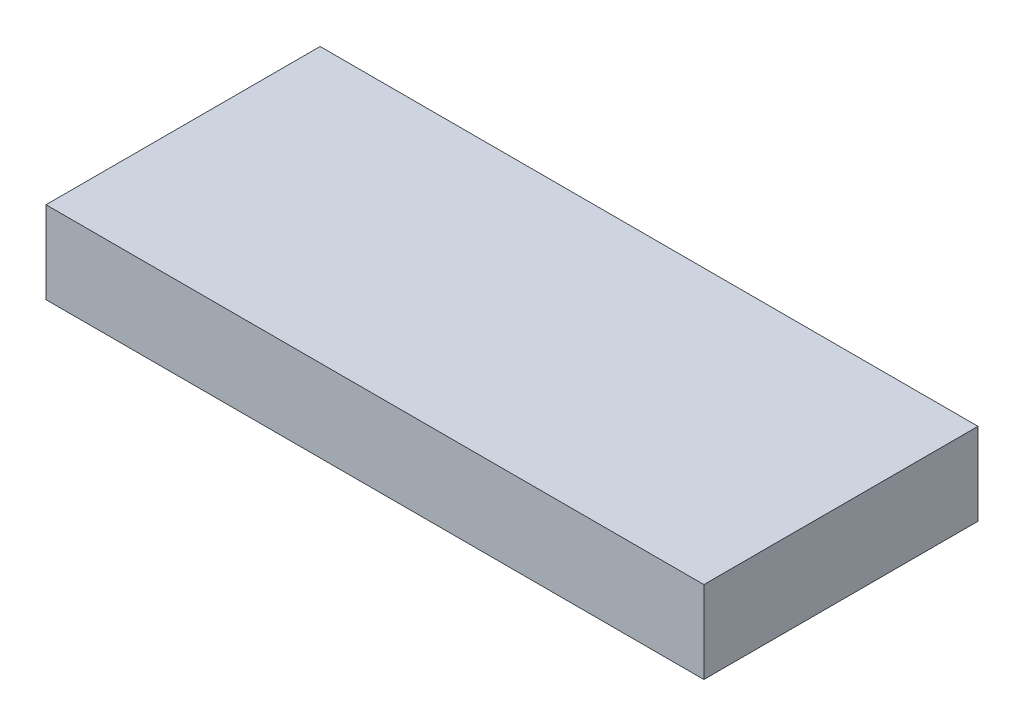
ISO-10303-21;
HEADER;
FILE_DESCRIPTION(('STEP AP214'),'2;1');
FILE_NAME('part.step','',(''),(''),'','','');
FILE_SCHEMA(('AUTOMOTIVE_DESIGN { 1 0 10303 214 1 1 1 1 }'));
ENDSEC;
DATA;
#1=APPLICATION_CONTEXT('core data for automotive mechanical design processes');
#2=APPLICATION_PROTOCOL_DEFINITION('international standard','automotive_design',2000,#1);
#3=PRODUCT_CONTEXT('',#1,'mechanical');
#4=PRODUCT('Part','Part','',(#3));
#5=PRODUCT_RELATED_PRODUCT_CATEGORY('part','',(#4));
#6=PRODUCT_DEFINITION_FORMATION('','',#4);
#7=PRODUCT_DEFINITION_CONTEXT('part definition',#1,'design');
#8=PRODUCT_DEFINITION('design','',#6,#7);
#9=PRODUCT_DEFINITION_SHAPE('','',#8);
#10=(LENGTH_UNIT() NAMED_UNIT(*) SI_UNIT(.MILLI.,.METRE.));
#11=(NAMED_UNIT(*) PLANE_ANGLE_UNIT() SI_UNIT($,.RADIAN.));
#12=(NAMED_UNIT(*) SI_UNIT($,.STERADIAN.) SOLID_ANGLE_UNIT());
#13=UNCERTAINTY_MEASURE_WITH_UNIT(LENGTH_MEASURE(1.E-05),#10,'distance_accuracy_value','');
#14=(GEOMETRIC_REPRESENTATION_CONTEXT(3) GLOBAL_UNCERTAINTY_ASSIGNED_CONTEXT((#13)) GLOBAL_UNIT_ASSIGNED_CONTEXT((#10,
#11,#12)) REPRESENTATION_CONTEXT('',''));
#15=CARTESIAN_POINT('',(0.,0.,0.));
#16=DIRECTION('',(0.,0.,1.));
#17=DIRECTION('',(1.,0.,0.));
#18=AXIS2_PLACEMENT_3D('',#15,#16,#17);
#19=CARTESIAN_POINT('',(-35.9516422743168,4.5,-14.2134399689159));
#20=DIRECTION('',(1.,0.,0.));
#21=DIRECTION('',(0.,0.,-1.));
#22=AXIS2_PLACEMENT_3D('',#19,#20,#21);
#23=PLANE('',#22);
#24=DIRECTION('',(0.,0.,1.));
#25=VECTOR('',#24,1.);
#26=CARTESIAN_POINT('',(-35.9516422743168,0.,-14.2134399689159));
#27=LINE('',#26,#25);
#28=CARTESIAN_POINT('',(-35.9516422743168,0.,-14.2134399689159));
#29=VERTEX_POINT('',#28);
#30=CARTESIAN_POINT('',(-35.9516422743168,0.,0.786560031084058));
#31=VERTEX_POINT('',#30);
#32=EDGE_CURVE('E95',#29,#31,#27,.T.);
#33=ORIENTED_EDGE('',*,*,#32,.T.);
#34=DIRECTION('',(0.,-1.,0.));
#35=VECTOR('',#34,1.);
#36=CARTESIAN_POINT('',(-35.9516422743168,4.5,0.786560031084058));
#37=LINE('',#36,#35);
#38=CARTESIAN_POINT('',(-35.9516422743168,4.5,0.786560031084058));
#39=VERTEX_POINT('',#38);
#40=EDGE_CURVE('E11',#39,#31,#37,.T.);
#41=ORIENTED_EDGE('',*,*,#40,.F.);
#42=DIRECTION('',(0.,0.,1.));
#43=VECTOR('',#42,1.);
#44=CARTESIAN_POINT('',(-35.9516422743168,4.5,-14.2134399689159));
#45=LINE('',#44,#43);
#46=CARTESIAN_POINT('',(-35.9516422743168,4.5,-14.2134399689159));
#47=VERTEX_POINT('',#46);
#48=EDGE_CURVE('E83',#47,#39,#45,.T.);
#49=ORIENTED_EDGE('',*,*,#48,.F.);
#50=DIRECTION('',(0.,-1.,0.));
#51=VECTOR('',#50,1.);
#52=CARTESIAN_POINT('',(-35.9516422743168,4.5,-14.2134399689159));
#53=LINE('',#52,#51);
#54=EDGE_CURVE('E91',#47,#29,#53,.T.);
#55=ORIENTED_EDGE('',*,*,#54,.T.);
#56=EDGE_LOOP('',(#33,#41,#49,#55));
#57=FACE_BOUND('',#56,.T.);
#58=ADVANCED_FACE('F32',(#57),#23,.F.);
#59=CARTESIAN_POINT('',(-35.9516422743168,4.5,0.786560031084058));
#60=DIRECTION('',(0.,0.,-1.));
#61=DIRECTION('',(-1.,0.,0.));
#62=AXIS2_PLACEMENT_3D('',#59,#60,#61);
#63=PLANE('',#62);
#64=DIRECTION('',(1.,0.,0.));
#65=VECTOR('',#64,1.);
#66=CARTESIAN_POINT('',(-35.9516422743168,0.,0.786560031084058));
#67=LINE('',#66,#65);
#68=CARTESIAN_POINT('',(0.0483577256832017,0.,0.786560031084058));
#69=VERTEX_POINT('',#68);
#70=EDGE_CURVE('E87',#31,#69,#67,.T.);
#71=ORIENTED_EDGE('',*,*,#70,.T.);
#72=DIRECTION('',(0.,-1.,0.));
#73=VECTOR('',#72,1.);
#74=CARTESIAN_POINT('',(0.0483577256832017,4.5,0.786560031084058));
#75=LINE('',#74,#73);
#76=CARTESIAN_POINT('',(0.0483577256832017,4.5,0.786560031084058));
#77=VERTEX_POINT('',#76);
#78=EDGE_CURVE('E40',#77,#69,#75,.T.);
#79=ORIENTED_EDGE('',*,*,#78,.F.);
#80=DIRECTION('',(1.,0.,0.));
#81=VECTOR('',#80,1.);
#82=CARTESIAN_POINT('',(-35.9516422743168,4.5,0.786560031084058));
#83=LINE('',#82,#81);
#84=EDGE_CURVE('E78',#39,#77,#83,.T.);
#85=ORIENTED_EDGE('',*,*,#84,.F.);
#86=ORIENTED_EDGE('',*,*,#40,.T.);
#87=EDGE_LOOP('',(#71,#79,#85,#86));
#88=FACE_BOUND('',#87,.T.);
#89=ADVANCED_FACE('F86',(#88),#63,.F.);
#90=CARTESIAN_POINT('',(0.0483577256831999,4.5,-14.2134399689159));
#91=DIRECTION('',(-1.,0.,0.));
#92=DIRECTION('',(0.,0.,1.));
#93=AXIS2_PLACEMENT_3D('',#90,#91,#92);
#94=PLANE('',#93);
#95=DIRECTION('',(0.,0.,-1.));
#96=VECTOR('',#95,1.);
#97=CARTESIAN_POINT('',(0.0483577256831999,0.,-14.2134399689159));
#98=LINE('',#97,#96);
#99=CARTESIAN_POINT('',(0.0483577256831999,0.,-14.2134399689159));
#100=VERTEX_POINT('',#99);
#101=EDGE_CURVE('E65',#69,#100,#98,.T.);
#102=ORIENTED_EDGE('',*,*,#101,.T.);
#103=DIRECTION('',(0.,-1.,0.));
#104=VECTOR('',#103,1.);
#105=CARTESIAN_POINT('',(0.0483577256831999,4.5,-14.2134399689159));
#106=LINE('',#105,#104);
#107=CARTESIAN_POINT('',(0.0483577256831999,4.5,-14.2134399689159));
#108=VERTEX_POINT('',#107);
#109=EDGE_CURVE('E88',#108,#100,#106,.T.);
#110=ORIENTED_EDGE('',*,*,#109,.F.);
#111=DIRECTION('',(0.,0.,-1.));
#112=VECTOR('',#111,1.);
#113=CARTESIAN_POINT('',(0.0483577256831999,4.5,-14.2134399689159));
#114=LINE('',#113,#112);
#115=EDGE_CURVE('E81',#77,#108,#114,.T.);
#116=ORIENTED_EDGE('',*,*,#115,.F.);
#117=ORIENTED_EDGE('',*,*,#78,.T.);
#118=EDGE_LOOP('',(#102,#110,#116,#117));
#119=FACE_BOUND('',#118,.T.);
#120=ADVANCED_FACE('F89',(#119),#94,.F.);
#121=CARTESIAN_POINT('',(-35.9516422743168,4.5,-14.2134399689159));
#122=DIRECTION('',(0.,0.,1.));
#123=DIRECTION('',(1.,0.,0.));
#124=AXIS2_PLACEMENT_3D('',#121,#122,#123);
#125=PLANE('',#124);
#126=DIRECTION('',(-1.,0.,0.));
#127=VECTOR('',#126,1.);
#128=CARTESIAN_POINT('',(-35.9516422743168,0.,-14.2134399689159));
#129=LINE('',#128,#127);
#130=EDGE_CURVE('E71',#100,#29,#129,.T.);
#131=ORIENTED_EDGE('',*,*,#130,.T.);
#132=ORIENTED_EDGE('',*,*,#54,.F.);
#133=DIRECTION('',(-1.,0.,0.));
#134=VECTOR('',#133,1.);
#135=CARTESIAN_POINT('',(-35.9516422743168,4.5,-14.2134399689159));
#136=LINE('',#135,#134);
#137=EDGE_CURVE('E48',#108,#47,#136,.T.);
#138=ORIENTED_EDGE('',*,*,#137,.F.);
#139=ORIENTED_EDGE('',*,*,#109,.T.);
#140=EDGE_LOOP('',(#131,#132,#138,#139));
#141=FACE_BOUND('',#140,.T.);
#142=ADVANCED_FACE('F102',(#141),#125,.F.);
#143=CARTESIAN_POINT('',(0.,4.5,0.));
#144=DIRECTION('',(0.,1.,0.));
#145=DIRECTION('',(0.,0.,1.));
#146=AXIS2_PLACEMENT_3D('',#143,#144,#145);
#147=PLANE('',#146);
#148=ORIENTED_EDGE('',*,*,#48,.T.);
#149=ORIENTED_EDGE('',*,*,#84,.T.);
#150=ORIENTED_EDGE('',*,*,#115,.T.);
#151=ORIENTED_EDGE('',*,*,#137,.T.);
#152=EDGE_LOOP('',(#148,#149,#150,#151));
#153=FACE_BOUND('',#152,.T.);
#154=ADVANCED_FACE('F79',(#153),#147,.T.);
#155=CARTESIAN_POINT('',(0.,0.,0.));
#156=DIRECTION('',(0.,1.,0.));
#157=DIRECTION('',(0.,0.,1.));
#158=AXIS2_PLACEMENT_3D('',#155,#156,#157);
#159=PLANE('',#158);
#160=ORIENTED_EDGE('',*,*,#32,.F.);
#161=ORIENTED_EDGE('',*,*,#130,.F.);
#162=ORIENTED_EDGE('',*,*,#101,.F.);
#163=ORIENTED_EDGE('',*,*,#70,.F.);
#164=EDGE_LOOP('',(#160,#161,#162,#163));
#165=FACE_BOUND('',#164,.T.);
#166=ADVANCED_FACE('F105',(#165),#159,.F.);
#167=CLOSED_SHELL('',(#58,#89,#120,#142,#154,#166));
#168=MANIFOLD_SOLID_BREP('B2',#167);
#169=ADVANCED_BREP_SHAPE_REPRESENTATION('',(#18,#168),#14);
#170=SHAPE_DEFINITION_REPRESENTATION(#9,#169);
ENDSEC;
END-ISO-10303-21;
